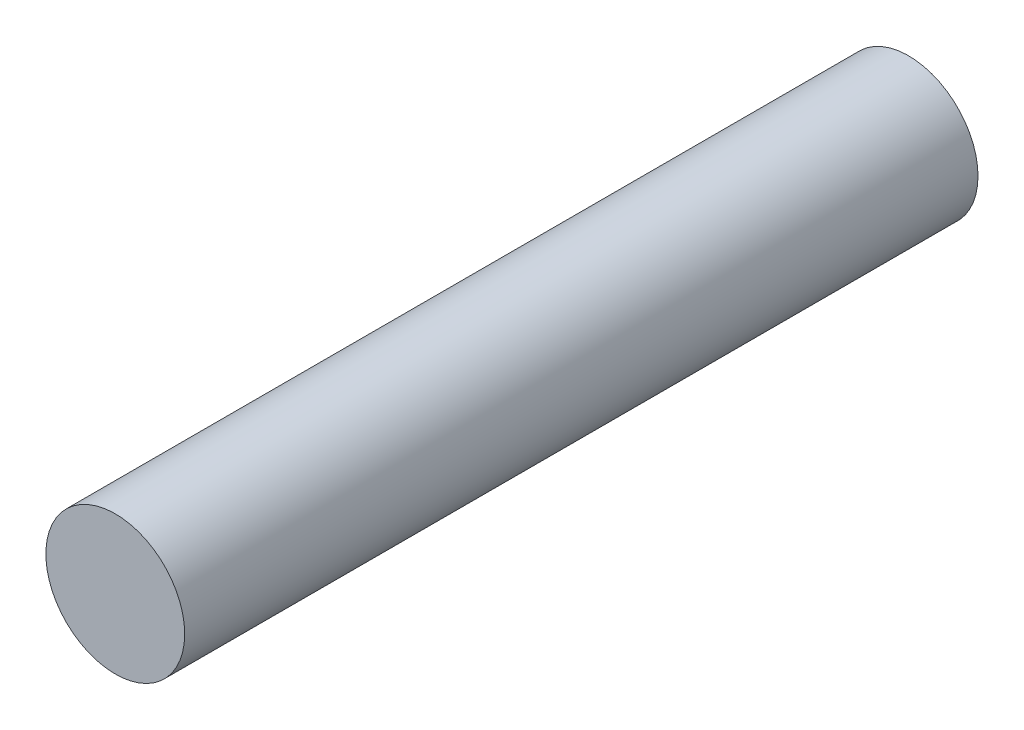
ISO-10303-21;
HEADER;
FILE_DESCRIPTION(('STEP AP214'),'2;1');
FILE_NAME('part.step','',(''),(''),'','','');
FILE_SCHEMA(('AUTOMOTIVE_DESIGN { 1 0 10303 214 1 1 1 1 }'));
ENDSEC;
DATA;
#1=APPLICATION_CONTEXT('core data for automotive mechanical design processes');
#2=APPLICATION_PROTOCOL_DEFINITION('international standard','automotive_design',2000,#1);
#3=PRODUCT_CONTEXT('',#1,'mechanical');
#4=PRODUCT('Part','Part','',(#3));
#5=PRODUCT_RELATED_PRODUCT_CATEGORY('part','',(#4));
#6=PRODUCT_DEFINITION_FORMATION('','',#4);
#7=PRODUCT_DEFINITION_CONTEXT('part definition',#1,'design');
#8=PRODUCT_DEFINITION('design','',#6,#7);
#9=PRODUCT_DEFINITION_SHAPE('','',#8);
#10=(LENGTH_UNIT() NAMED_UNIT(*) SI_UNIT(.MILLI.,.METRE.));
#11=(NAMED_UNIT(*) PLANE_ANGLE_UNIT() SI_UNIT($,.RADIAN.));
#12=(NAMED_UNIT(*) SI_UNIT($,.STERADIAN.) SOLID_ANGLE_UNIT());
#13=UNCERTAINTY_MEASURE_WITH_UNIT(LENGTH_MEASURE(1.E-05),#10,'distance_accuracy_value','');
#14=(GEOMETRIC_REPRESENTATION_CONTEXT(3) GLOBAL_UNCERTAINTY_ASSIGNED_CONTEXT((#13)) GLOBAL_UNIT_ASSIGNED_CONTEXT((#10,
#11,#12)) REPRESENTATION_CONTEXT('',''));
#15=CARTESIAN_POINT('',(0.,0.,0.));
#16=DIRECTION('',(0.,0.,1.));
#17=DIRECTION('',(1.,0.,0.));
#18=AXIS2_PLACEMENT_3D('',#15,#16,#17);
#19=CARTESIAN_POINT('',(0.,0.,40.));
#20=DIRECTION('',(0.,0.,-1.));
#21=DIRECTION('',(-1.,0.,0.));
#22=AXIS2_PLACEMENT_3D('',#19,#20,#21);
#23=CYLINDRICAL_SURFACE('',#22,3.5);
#24=CARTESIAN_POINT('',(0.,0.,40.));
#25=DIRECTION('',(0.,0.,1.));
#26=DIRECTION('',(1.,0.,0.));
#27=AXIS2_PLACEMENT_3D('',#24,#25,#26);
#28=CIRCLE('',#27,3.5);
#29=CARTESIAN_POINT('',(3.5,0.,40.));
#30=VERTEX_POINT('',#29);
#31=EDGE_CURVE('E10',#30,#30,#28,.T.);
#32=ORIENTED_EDGE('',*,*,#31,.F.);
#33=EDGE_LOOP('',(#32));
#34=FACE_BOUND('',#33,.T.);
#35=CARTESIAN_POINT('',(0.,0.,0.));
#36=DIRECTION('',(0.,0.,1.));
#37=DIRECTION('',(1.,0.,0.));
#38=AXIS2_PLACEMENT_3D('',#35,#36,#37);
#39=CIRCLE('',#38,3.5);
#40=CARTESIAN_POINT('',(3.5,0.,0.));
#41=VERTEX_POINT('',#40);
#42=EDGE_CURVE('E44',#41,#41,#39,.T.);
#43=ORIENTED_EDGE('',*,*,#42,.T.);
#44=EDGE_LOOP('',(#43));
#45=FACE_BOUND('',#44,.T.);
#46=ADVANCED_FACE('F41',(#34,#45),#23,.T.);
#47=CARTESIAN_POINT('',(0.,0.,40.));
#48=DIRECTION('',(0.,0.,1.));
#49=DIRECTION('',(1.,0.,0.));
#50=AXIS2_PLACEMENT_3D('',#47,#48,#49);
#51=PLANE('',#50);
#52=ORIENTED_EDGE('',*,*,#31,.T.);
#53=EDGE_LOOP('',(#52));
#54=FACE_BOUND('',#53,.T.);
#55=ADVANCED_FACE('F58',(#54),#51,.T.);
#56=CARTESIAN_POINT('',(0.,0.,0.));
#57=DIRECTION('',(0.,0.,1.));
#58=DIRECTION('',(1.,0.,0.));
#59=AXIS2_PLACEMENT_3D('',#56,#57,#58);
#60=PLANE('',#59);
#61=ORIENTED_EDGE('',*,*,#42,.F.);
#62=EDGE_LOOP('',(#61));
#63=FACE_BOUND('',#62,.T.);
#64=ADVANCED_FACE('F56',(#63),#60,.F.);
#65=CLOSED_SHELL('',(#46,#55,#64));
#66=MANIFOLD_SOLID_BREP('B2',#65);
#67=ADVANCED_BREP_SHAPE_REPRESENTATION('',(#18,#66),#14);
#68=SHAPE_DEFINITION_REPRESENTATION(#9,#67);
ENDSEC;
END-ISO-10303-21;
